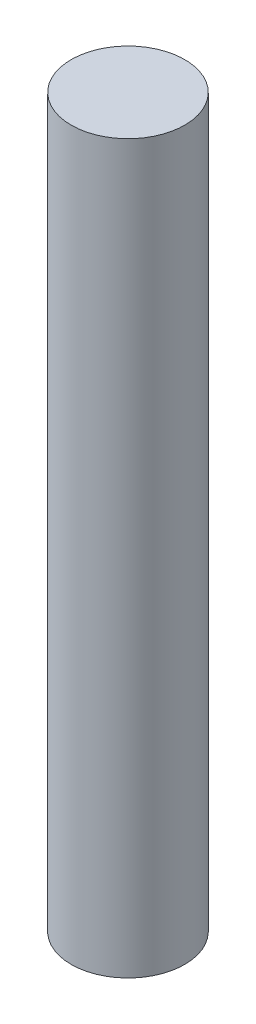
ISO-10303-21;
HEADER;
FILE_DESCRIPTION(('STEP AP214'),'2;1');
FILE_NAME('part.step','',(''),(''),'','','');
FILE_SCHEMA(('AUTOMOTIVE_DESIGN { 1 0 10303 214 1 1 1 1 }'));
ENDSEC;
DATA;
#1=APPLICATION_CONTEXT('core data for automotive mechanical design processes');
#2=APPLICATION_PROTOCOL_DEFINITION('international standard','automotive_design',2000,#1);
#3=PRODUCT_CONTEXT('',#1,'mechanical');
#4=PRODUCT('Part','Part','',(#3));
#5=PRODUCT_RELATED_PRODUCT_CATEGORY('part','',(#4));
#6=PRODUCT_DEFINITION_FORMATION('','',#4);
#7=PRODUCT_DEFINITION_CONTEXT('part definition',#1,'design');
#8=PRODUCT_DEFINITION('design','',#6,#7);
#9=PRODUCT_DEFINITION_SHAPE('','',#8);
#10=(LENGTH_UNIT() NAMED_UNIT(*) SI_UNIT(.MILLI.,.METRE.));
#11=(NAMED_UNIT(*) PLANE_ANGLE_UNIT() SI_UNIT($,.RADIAN.));
#12=(NAMED_UNIT(*) SI_UNIT($,.STERADIAN.) SOLID_ANGLE_UNIT());
#13=UNCERTAINTY_MEASURE_WITH_UNIT(LENGTH_MEASURE(1.E-05),#10,'distance_accuracy_value','');
#14=(GEOMETRIC_REPRESENTATION_CONTEXT(3) GLOBAL_UNCERTAINTY_ASSIGNED_CONTEXT((#13)) GLOBAL_UNIT_ASSIGNED_CONTEXT((#10,
#11,#12)) REPRESENTATION_CONTEXT('',''));
#15=CARTESIAN_POINT('',(0.,0.,0.));
#16=DIRECTION('',(0.,0.,1.));
#17=DIRECTION('',(1.,0.,0.));
#18=AXIS2_PLACEMENT_3D('',#15,#16,#17);
#19=CARTESIAN_POINT('',(0.,50.8,0.));
#20=DIRECTION('',(0.,-1.,0.));
#21=DIRECTION('',(0.,0.,-1.));
#22=AXIS2_PLACEMENT_3D('',#19,#20,#21);
#23=CYLINDRICAL_SURFACE('',#22,3.96875);
#24=CARTESIAN_POINT('',(0.,50.8,0.));
#25=DIRECTION('',(0.,1.,0.));
#26=DIRECTION('',(0.,0.,1.));
#27=AXIS2_PLACEMENT_3D('',#24,#25,#26);
#28=CIRCLE('',#27,3.96875);
#29=CARTESIAN_POINT('',(0.,50.8,3.96875));
#30=VERTEX_POINT('',#29);
#31=EDGE_CURVE('E10',#30,#30,#28,.T.);
#32=ORIENTED_EDGE('',*,*,#31,.F.);
#33=EDGE_LOOP('',(#32));
#34=FACE_BOUND('',#33,.T.);
#35=CARTESIAN_POINT('',(0.,0.,0.));
#36=DIRECTION('',(0.,1.,0.));
#37=DIRECTION('',(0.,0.,1.));
#38=AXIS2_PLACEMENT_3D('',#35,#36,#37);
#39=CIRCLE('',#38,3.96875);
#40=CARTESIAN_POINT('',(0.,0.,3.96875));
#41=VERTEX_POINT('',#40);
#42=EDGE_CURVE('E34',#41,#41,#39,.T.);
#43=ORIENTED_EDGE('',*,*,#42,.T.);
#44=EDGE_LOOP('',(#43));
#45=FACE_BOUND('',#44,.T.);
#46=ADVANCED_FACE('F31',(#34,#45),#23,.T.);
#47=CARTESIAN_POINT('',(0.,50.8,0.));
#48=DIRECTION('',(0.,1.,0.));
#49=DIRECTION('',(0.,0.,1.));
#50=AXIS2_PLACEMENT_3D('',#47,#48,#49);
#51=PLANE('',#50);
#52=ORIENTED_EDGE('',*,*,#31,.T.);
#53=EDGE_LOOP('',(#52));
#54=FACE_BOUND('',#53,.T.);
#55=ADVANCED_FACE('F46',(#54),#51,.T.);
#56=CARTESIAN_POINT('',(0.,0.,0.));
#57=DIRECTION('',(0.,1.,0.));
#58=DIRECTION('',(0.,0.,1.));
#59=AXIS2_PLACEMENT_3D('',#56,#57,#58);
#60=PLANE('',#59);
#61=ORIENTED_EDGE('',*,*,#42,.F.);
#62=EDGE_LOOP('',(#61));
#63=FACE_BOUND('',#62,.T.);
#64=ADVANCED_FACE('F44',(#63),#60,.F.);
#65=CLOSED_SHELL('',(#46,#55,#64));
#66=MANIFOLD_SOLID_BREP('B2',#65);
#67=ADVANCED_BREP_SHAPE_REPRESENTATION('',(#18,#66),#14);
#68=SHAPE_DEFINITION_REPRESENTATION(#9,#67);
ENDSEC;
END-ISO-10303-21;
